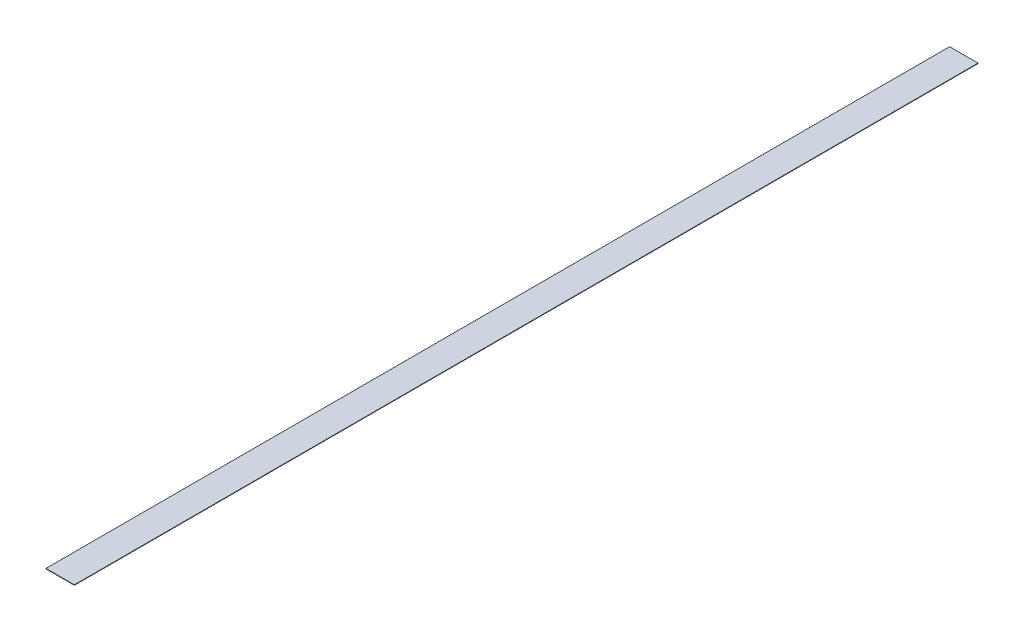
ISO-10303-21;
HEADER;
FILE_DESCRIPTION(('STEP AP214'),'2;1');
FILE_NAME('part.step','',(''),(''),'','','');
FILE_SCHEMA(('AUTOMOTIVE_DESIGN { 1 0 10303 214 1 1 1 1 }'));
ENDSEC;
DATA;
#1=APPLICATION_CONTEXT('core data for automotive mechanical design processes');
#2=APPLICATION_PROTOCOL_DEFINITION('international standard','automotive_design',2000,#1);
#3=PRODUCT_CONTEXT('',#1,'mechanical');
#4=PRODUCT('Part','Part','',(#3));
#5=PRODUCT_RELATED_PRODUCT_CATEGORY('part','',(#4));
#6=PRODUCT_DEFINITION_FORMATION('','',#4);
#7=PRODUCT_DEFINITION_CONTEXT('part definition',#1,'design');
#8=PRODUCT_DEFINITION('design','',#6,#7);
#9=PRODUCT_DEFINITION_SHAPE('','',#8);
#10=(LENGTH_UNIT() NAMED_UNIT(*) SI_UNIT(.MILLI.,.METRE.));
#11=(NAMED_UNIT(*) PLANE_ANGLE_UNIT() SI_UNIT($,.RADIAN.));
#12=(NAMED_UNIT(*) SI_UNIT($,.STERADIAN.) SOLID_ANGLE_UNIT());
#13=UNCERTAINTY_MEASURE_WITH_UNIT(LENGTH_MEASURE(1.E-05),#10,'distance_accuracy_value','');
#14=(GEOMETRIC_REPRESENTATION_CONTEXT(3) GLOBAL_UNCERTAINTY_ASSIGNED_CONTEXT((#13)) GLOBAL_UNIT_ASSIGNED_CONTEXT((#10,
#11,#12)) REPRESENTATION_CONTEXT('',''));
#15=CARTESIAN_POINT('',(0.,0.,0.));
#16=DIRECTION('',(0.,0.,1.));
#17=DIRECTION('',(1.,0.,0.));
#18=AXIS2_PLACEMENT_3D('',#15,#16,#17);
#19=CARTESIAN_POINT('',(25.3999999999999,0.79375,-808.037499999999));
#20=DIRECTION('',(-1.,0.,0.));
#21=DIRECTION('',(0.,0.,1.));
#22=AXIS2_PLACEMENT_3D('',#19,#20,#21);
#23=PLANE('',#22);
#24=DIRECTION('',(0.,0.,-1.));
#25=VECTOR('',#24,1.);
#26=CARTESIAN_POINT('',(25.3999999999999,0.,-808.037499999999));
#27=LINE('',#26,#25);
#28=CARTESIAN_POINT('',(25.4000000000001,0.,808.037500000001));
#29=VERTEX_POINT('',#28);
#30=CARTESIAN_POINT('',(25.3999999999999,0.,-808.037499999999));
#31=VERTEX_POINT('',#30);
#32=EDGE_CURVE('E96',#29,#31,#27,.T.);
#33=ORIENTED_EDGE('',*,*,#32,.T.);
#34=DIRECTION('',(0.,-1.,0.));
#35=VECTOR('',#34,1.);
#36=CARTESIAN_POINT('',(25.3999999999999,0.79375,-808.037499999999));
#37=LINE('',#36,#35);
#38=CARTESIAN_POINT('',(25.3999999999999,0.79375,-808.037499999999));
#39=VERTEX_POINT('',#38);
#40=EDGE_CURVE('E11',#39,#31,#37,.T.);
#41=ORIENTED_EDGE('',*,*,#40,.F.);
#42=DIRECTION('',(0.,0.,-1.));
#43=VECTOR('',#42,1.);
#44=CARTESIAN_POINT('',(25.3999999999999,0.79375,-808.037499999999));
#45=LINE('',#44,#43);
#46=CARTESIAN_POINT('',(25.4000000000001,0.79375,808.037500000001));
#47=VERTEX_POINT('',#46);
#48=EDGE_CURVE('E84',#47,#39,#45,.T.);
#49=ORIENTED_EDGE('',*,*,#48,.F.);
#50=DIRECTION('',(0.,-1.,0.));
#51=VECTOR('',#50,1.);
#52=CARTESIAN_POINT('',(25.4000000000001,0.79375,808.037500000001));
#53=LINE('',#52,#51);
#54=EDGE_CURVE('E92',#47,#29,#53,.T.);
#55=ORIENTED_EDGE('',*,*,#54,.T.);
#56=EDGE_LOOP('',(#33,#41,#49,#55));
#57=FACE_BOUND('',#56,.T.);
#58=ADVANCED_FACE('F33',(#57),#23,.F.);
#59=CARTESIAN_POINT('',(-25.4000000000001,0.79375,-808.037499999999));
#60=DIRECTION('',(0.,0.,1.));
#61=DIRECTION('',(1.,0.,0.));
#62=AXIS2_PLACEMENT_3D('',#59,#60,#61);
#63=PLANE('',#62);
#64=DIRECTION('',(-1.,0.,0.));
#65=VECTOR('',#64,1.);
#66=CARTESIAN_POINT('',(-25.4000000000001,0.,-808.037499999999));
#67=LINE('',#66,#65);
#68=CARTESIAN_POINT('',(-25.4000000000001,0.,-808.037499999999));
#69=VERTEX_POINT('',#68);
#70=EDGE_CURVE('E88',#31,#69,#67,.T.);
#71=ORIENTED_EDGE('',*,*,#70,.T.);
#72=DIRECTION('',(0.,-1.,0.));
#73=VECTOR('',#72,1.);
#74=CARTESIAN_POINT('',(-25.4000000000001,0.79375,-808.037499999999));
#75=LINE('',#74,#73);
#76=CARTESIAN_POINT('',(-25.4000000000001,0.79375,-808.037499999999));
#77=VERTEX_POINT('',#76);
#78=EDGE_CURVE('E41',#77,#69,#75,.T.);
#79=ORIENTED_EDGE('',*,*,#78,.F.);
#80=DIRECTION('',(-1.,0.,0.));
#81=VECTOR('',#80,1.);
#82=CARTESIAN_POINT('',(-25.4000000000001,0.79375,-808.037499999999));
#83=LINE('',#82,#81);
#84=EDGE_CURVE('E79',#39,#77,#83,.T.);
#85=ORIENTED_EDGE('',*,*,#84,.F.);
#86=ORIENTED_EDGE('',*,*,#40,.T.);
#87=EDGE_LOOP('',(#71,#79,#85,#86));
#88=FACE_BOUND('',#87,.T.);
#89=ADVANCED_FACE('F87',(#88),#63,.F.);
#90=CARTESIAN_POINT('',(-25.4000000000001,0.79375,-808.037499999999));
#91=DIRECTION('',(1.,0.,0.));
#92=DIRECTION('',(0.,0.,-1.));
#93=AXIS2_PLACEMENT_3D('',#90,#91,#92);
#94=PLANE('',#93);
#95=DIRECTION('',(0.,0.,1.));
#96=VECTOR('',#95,1.);
#97=CARTESIAN_POINT('',(-25.4000000000001,0.,-808.037499999999));
#98=LINE('',#97,#96);
#99=CARTESIAN_POINT('',(-25.3999999999999,0.,808.037500000001));
#100=VERTEX_POINT('',#99);
#101=EDGE_CURVE('E66',#69,#100,#98,.T.);
#102=ORIENTED_EDGE('',*,*,#101,.T.);
#103=DIRECTION('',(0.,-1.,0.));
#104=VECTOR('',#103,1.);
#105=CARTESIAN_POINT('',(-25.3999999999999,0.79375,808.037500000001));
#106=LINE('',#105,#104);
#107=CARTESIAN_POINT('',(-25.3999999999999,0.79375,808.037500000001));
#108=VERTEX_POINT('',#107);
#109=EDGE_CURVE('E89',#108,#100,#106,.T.);
#110=ORIENTED_EDGE('',*,*,#109,.F.);
#111=DIRECTION('',(0.,0.,1.));
#112=VECTOR('',#111,1.);
#113=CARTESIAN_POINT('',(-25.4000000000001,0.79375,-808.037499999999));
#114=LINE('',#113,#112);
#115=EDGE_CURVE('E82',#77,#108,#114,.T.);
#116=ORIENTED_EDGE('',*,*,#115,.F.);
#117=ORIENTED_EDGE('',*,*,#78,.T.);
#118=EDGE_LOOP('',(#102,#110,#116,#117));
#119=FACE_BOUND('',#118,.T.);
#120=ADVANCED_FACE('F90',(#119),#94,.F.);
#121=CARTESIAN_POINT('',(-25.3999999999999,0.79375,808.037500000001));
#122=DIRECTION('',(0.,0.,-1.));
#123=DIRECTION('',(-1.,0.,0.));
#124=AXIS2_PLACEMENT_3D('',#121,#122,#123);
#125=PLANE('',#124);
#126=DIRECTION('',(1.,0.,0.));
#127=VECTOR('',#126,1.);
#128=CARTESIAN_POINT('',(-25.3999999999999,0.,808.037500000001));
#129=LINE('',#128,#127);
#130=EDGE_CURVE('E72',#100,#29,#129,.T.);
#131=ORIENTED_EDGE('',*,*,#130,.T.);
#132=ORIENTED_EDGE('',*,*,#54,.F.);
#133=DIRECTION('',(1.,0.,0.));
#134=VECTOR('',#133,1.);
#135=CARTESIAN_POINT('',(-25.3999999999999,0.79375,808.037500000001));
#136=LINE('',#135,#134);
#137=EDGE_CURVE('E49',#108,#47,#136,.T.);
#138=ORIENTED_EDGE('',*,*,#137,.F.);
#139=ORIENTED_EDGE('',*,*,#109,.T.);
#140=EDGE_LOOP('',(#131,#132,#138,#139));
#141=FACE_BOUND('',#140,.T.);
#142=ADVANCED_FACE('F103',(#141),#125,.F.);
#143=CARTESIAN_POINT('',(0.,0.79375,0.));
#144=DIRECTION('',(0.,1.,0.));
#145=DIRECTION('',(0.,0.,1.));
#146=AXIS2_PLACEMENT_3D('',#143,#144,#145);
#147=PLANE('',#146);
#148=ORIENTED_EDGE('',*,*,#48,.T.);
#149=ORIENTED_EDGE('',*,*,#84,.T.);
#150=ORIENTED_EDGE('',*,*,#115,.T.);
#151=ORIENTED_EDGE('',*,*,#137,.T.);
#152=EDGE_LOOP('',(#148,#149,#150,#151));
#153=FACE_BOUND('',#152,.T.);
#154=ADVANCED_FACE('F80',(#153),#147,.T.);
#155=CARTESIAN_POINT('',(0.,0.,0.));
#156=DIRECTION('',(0.,1.,0.));
#157=DIRECTION('',(0.,0.,1.));
#158=AXIS2_PLACEMENT_3D('',#155,#156,#157);
#159=PLANE('',#158);
#160=ORIENTED_EDGE('',*,*,#32,.F.);
#161=ORIENTED_EDGE('',*,*,#130,.F.);
#162=ORIENTED_EDGE('',*,*,#101,.F.);
#163=ORIENTED_EDGE('',*,*,#70,.F.);
#164=EDGE_LOOP('',(#160,#161,#162,#163));
#165=FACE_BOUND('',#164,.T.);
#166=ADVANCED_FACE('F106',(#165),#159,.F.);
#167=CLOSED_SHELL('',(#58,#89,#120,#142,#154,#166));
#168=MANIFOLD_SOLID_BREP('B2',#167);
#169=ADVANCED_BREP_SHAPE_REPRESENTATION('',(#18,#168),#14);
#170=SHAPE_DEFINITION_REPRESENTATION(#9,#169);
ENDSEC;
END-ISO-10303-21;
